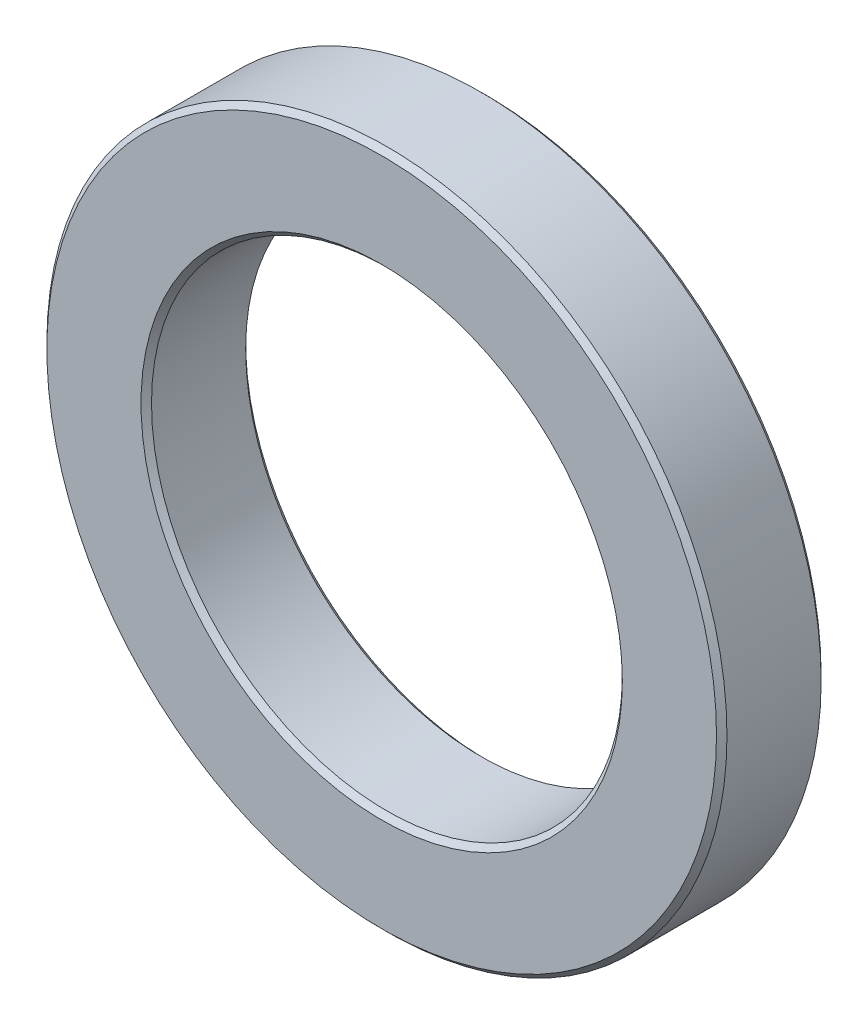
ISO-10303-21;
HEADER;
FILE_DESCRIPTION(('STEP AP214'),'2;1');
FILE_NAME('part.step','',(''),(''),'','','');
FILE_SCHEMA(('AUTOMOTIVE_DESIGN { 1 0 10303 214 1 1 1 1 }'));
ENDSEC;
DATA;
#1=APPLICATION_CONTEXT('core data for automotive mechanical design processes');
#2=APPLICATION_PROTOCOL_DEFINITION('international standard','automotive_design',2000,#1);
#3=PRODUCT_CONTEXT('',#1,'mechanical');
#4=PRODUCT('Part','Part','',(#3));
#5=PRODUCT_RELATED_PRODUCT_CATEGORY('part','',(#4));
#6=PRODUCT_DEFINITION_FORMATION('','',#4);
#7=PRODUCT_DEFINITION_CONTEXT('part definition',#1,'design');
#8=PRODUCT_DEFINITION('design','',#6,#7);
#9=PRODUCT_DEFINITION_SHAPE('','',#8);
#10=(LENGTH_UNIT() NAMED_UNIT(*) SI_UNIT(.MILLI.,.METRE.));
#11=(NAMED_UNIT(*) PLANE_ANGLE_UNIT() SI_UNIT($,.RADIAN.));
#12=(NAMED_UNIT(*) SI_UNIT($,.STERADIAN.) SOLID_ANGLE_UNIT());
#13=UNCERTAINTY_MEASURE_WITH_UNIT(LENGTH_MEASURE(1.E-05),#10,'distance_accuracy_value','');
#14=(GEOMETRIC_REPRESENTATION_CONTEXT(3) GLOBAL_UNCERTAINTY_ASSIGNED_CONTEXT((#13)) GLOBAL_UNIT_ASSIGNED_CONTEXT((#10,
#11,#12)) REPRESENTATION_CONTEXT('',''));
#15=CARTESIAN_POINT('',(0.,0.,0.));
#16=DIRECTION('',(0.,0.,1.));
#17=DIRECTION('',(1.,0.,0.));
#18=AXIS2_PLACEMENT_3D('',#15,#16,#17);
#19=CARTESIAN_POINT('',(0.,0.,10.));
#20=DIRECTION('',(0.,0.,1.));
#21=DIRECTION('',(1.,0.,0.));
#22=AXIS2_PLACEMENT_3D('',#19,#20,#21);
#23=PLANE('',#22);
#24=CARTESIAN_POINT('',(0.,0.,10.));
#25=DIRECTION('',(0.,0.,1.));
#26=DIRECTION('',(1.,0.,0.));
#27=AXIS2_PLACEMENT_3D('',#24,#25,#26);
#28=CIRCLE('',#27,23.);
#29=CARTESIAN_POINT('',(23.,0.,10.));
#30=VERTEX_POINT('',#29);
#31=EDGE_CURVE('E10',#30,#30,#28,.F.);
#32=ORIENTED_EDGE('',*,*,#31,.T.);
#33=EDGE_LOOP('',(#32));
#34=FACE_BOUND('',#33,.T.);
#35=CARTESIAN_POINT('',(0.,0.,10.));
#36=DIRECTION('',(0.,0.,1.));
#37=DIRECTION('',(1.,0.,0.));
#38=AXIS2_PLACEMENT_3D('',#35,#36,#37);
#39=CIRCLE('',#38,32.);
#40=CARTESIAN_POINT('',(32.,0.,10.));
#41=VERTEX_POINT('',#40);
#42=EDGE_CURVE('E48',#41,#41,#39,.T.);
#43=ORIENTED_EDGE('',*,*,#42,.T.);
#44=EDGE_LOOP('',(#43));
#45=FACE_BOUND('',#44,.T.);
#46=ADVANCED_FACE('F40',(#34,#45),#23,.T.);
#47=CARTESIAN_POINT('',(0.,0.,0.));
#48=DIRECTION('',(0.,0.,1.));
#49=DIRECTION('',(1.,0.,0.));
#50=AXIS2_PLACEMENT_3D('',#47,#48,#49);
#51=PLANE('',#50);
#52=CARTESIAN_POINT('',(0.,0.,0.));
#53=DIRECTION('',(0.,0.,1.));
#54=DIRECTION('',(1.,0.,0.));
#55=AXIS2_PLACEMENT_3D('',#52,#53,#54);
#56=CIRCLE('',#55,32.);
#57=CARTESIAN_POINT('',(32.,0.,0.));
#58=VERTEX_POINT('',#57);
#59=EDGE_CURVE('E61',#58,#58,#56,.F.);
#60=ORIENTED_EDGE('',*,*,#59,.T.);
#61=EDGE_LOOP('',(#60));
#62=FACE_BOUND('',#61,.T.);
#63=CARTESIAN_POINT('',(0.,0.,0.));
#64=DIRECTION('',(0.,0.,1.));
#65=DIRECTION('',(1.,0.,0.));
#66=AXIS2_PLACEMENT_3D('',#63,#64,#65);
#67=CIRCLE('',#66,23.);
#68=CARTESIAN_POINT('',(23.,0.,0.));
#69=VERTEX_POINT('',#68);
#70=EDGE_CURVE('E64',#69,#69,#67,.T.);
#71=ORIENTED_EDGE('',*,*,#70,.T.);
#72=EDGE_LOOP('',(#71));
#73=FACE_BOUND('',#72,.T.);
#74=ADVANCED_FACE('F85',(#62,#73),#51,.F.);
#75=CARTESIAN_POINT('',(0.,0.,10.));
#76=DIRECTION('',(0.,0.,-1.));
#77=DIRECTION('',(-1.,0.,0.));
#78=AXIS2_PLACEMENT_3D('',#75,#76,#77);
#79=CYLINDRICAL_SURFACE('',#78,32.5);
#80=CARTESIAN_POINT('',(0.,0.,0.500000000000014));
#81=DIRECTION('',(0.,0.,1.));
#82=DIRECTION('',(1.,0.,0.));
#83=AXIS2_PLACEMENT_3D('',#80,#81,#82);
#84=CIRCLE('',#83,32.5);
#85=CARTESIAN_POINT('',(32.5,0.,0.500000000000014));
#86=VERTEX_POINT('',#85);
#87=EDGE_CURVE('E67',#86,#86,#84,.T.);
#88=ORIENTED_EDGE('',*,*,#87,.T.);
#89=EDGE_LOOP('',(#88));
#90=FACE_BOUND('',#89,.T.);
#91=CARTESIAN_POINT('',(0.,0.,9.5));
#92=DIRECTION('',(0.,0.,1.));
#93=DIRECTION('',(1.,0.,0.));
#94=AXIS2_PLACEMENT_3D('',#91,#92,#93);
#95=CIRCLE('',#94,32.5);
#96=CARTESIAN_POINT('',(32.5,0.,9.5));
#97=VERTEX_POINT('',#96);
#98=EDGE_CURVE('E70',#97,#97,#95,.F.);
#99=ORIENTED_EDGE('',*,*,#98,.T.);
#100=EDGE_LOOP('',(#99));
#101=FACE_BOUND('',#100,.T.);
#102=ADVANCED_FACE('F74',(#90,#101),#79,.T.);
#103=CARTESIAN_POINT('',(0.,0.,10.));
#104=DIRECTION('',(0.,0.,-1.));
#105=DIRECTION('',(-1.,0.,0.));
#106=AXIS2_PLACEMENT_3D('',#103,#104,#105);
#107=CYLINDRICAL_SURFACE('',#106,22.5);
#108=CARTESIAN_POINT('',(0.,0.,0.500000000000004));
#109=DIRECTION('',(0.,0.,1.));
#110=DIRECTION('',(1.,0.,0.));
#111=AXIS2_PLACEMENT_3D('',#108,#109,#110);
#112=CIRCLE('',#111,22.5);
#113=CARTESIAN_POINT('',(22.5,0.,0.500000000000004));
#114=VERTEX_POINT('',#113);
#115=EDGE_CURVE('E52',#114,#114,#112,.F.);
#116=ORIENTED_EDGE('',*,*,#115,.T.);
#117=EDGE_LOOP('',(#116));
#118=FACE_BOUND('',#117,.T.);
#119=CARTESIAN_POINT('',(0.,0.,9.50000000000001));
#120=DIRECTION('',(0.,0.,1.));
#121=DIRECTION('',(1.,0.,0.));
#122=AXIS2_PLACEMENT_3D('',#119,#120,#121);
#123=CIRCLE('',#122,22.5);
#124=CARTESIAN_POINT('',(22.5,0.,9.50000000000001));
#125=VERTEX_POINT('',#124);
#126=EDGE_CURVE('E56',#125,#125,#123,.T.);
#127=ORIENTED_EDGE('',*,*,#126,.T.);
#128=EDGE_LOOP('',(#127));
#129=FACE_BOUND('',#128,.T.);
#130=ADVANCED_FACE('F93',(#118,#129),#107,.F.);
#131=CARTESIAN_POINT('',(0.,0.,0.500000000000014));
#132=DIRECTION('',(0.,0.,1.));
#133=DIRECTION('',(1.,0.,0.));
#134=AXIS2_PLACEMENT_3D('',#131,#132,#133);
#135=CONICAL_SURFACE('',#134,32.5,0.785398163397455);
#136=ORIENTED_EDGE('',*,*,#59,.F.);
#137=EDGE_LOOP('',(#136));
#138=FACE_BOUND('',#137,.T.);
#139=ORIENTED_EDGE('',*,*,#87,.F.);
#140=EDGE_LOOP('',(#139));
#141=FACE_BOUND('',#140,.T.);
#142=ADVANCED_FACE('F99',(#138,#141),#135,.T.);
#143=CARTESIAN_POINT('',(0.,0.,0.));
#144=DIRECTION('',(0.,0.,-1.));
#145=DIRECTION('',(-1.,0.,0.));
#146=AXIS2_PLACEMENT_3D('',#143,#144,#145);
#147=CONICAL_SURFACE('',#146,23.,0.785398163397441);
#148=ORIENTED_EDGE('',*,*,#115,.F.);
#149=EDGE_LOOP('',(#148));
#150=FACE_BOUND('',#149,.T.);
#151=ORIENTED_EDGE('',*,*,#70,.F.);
#152=EDGE_LOOP('',(#151));
#153=FACE_BOUND('',#152,.T.);
#154=ADVANCED_FACE('F82',(#150,#153),#147,.F.);
#155=CARTESIAN_POINT('',(0.,0.,9.50000000000001));
#156=DIRECTION('',(0.,0.,1.));
#157=DIRECTION('',(1.,0.,0.));
#158=AXIS2_PLACEMENT_3D('',#155,#156,#157);
#159=CONICAL_SURFACE('',#158,22.5,0.785398163397448);
#160=ORIENTED_EDGE('',*,*,#31,.F.);
#161=EDGE_LOOP('',(#160));
#162=FACE_BOUND('',#161,.T.);
#163=ORIENTED_EDGE('',*,*,#126,.F.);
#164=EDGE_LOOP('',(#163));
#165=FACE_BOUND('',#164,.T.);
#166=ADVANCED_FACE('F78',(#162,#165),#159,.F.);
#167=CARTESIAN_POINT('',(0.,0.,10.));
#168=DIRECTION('',(0.,0.,-1.));
#169=DIRECTION('',(-1.,0.,0.));
#170=AXIS2_PLACEMENT_3D('',#167,#168,#169);
#171=CONICAL_SURFACE('',#170,32.,0.785398163397448);
#172=ORIENTED_EDGE('',*,*,#98,.F.);
#173=EDGE_LOOP('',(#172));
#174=FACE_BOUND('',#173,.T.);
#175=ORIENTED_EDGE('',*,*,#42,.F.);
#176=EDGE_LOOP('',(#175));
#177=FACE_BOUND('',#176,.T.);
#178=ADVANCED_FACE('F43',(#174,#177),#171,.T.);
#179=CLOSED_SHELL('',(#46,#74,#102,#130,#142,#154,#166,#178));
#180=MANIFOLD_SOLID_BREP('B2',#179);
#181=ADVANCED_BREP_SHAPE_REPRESENTATION('',(#18,#180),#14);
#182=SHAPE_DEFINITION_REPRESENTATION(#9,#181);
ENDSEC;
END-ISO-10303-21;
